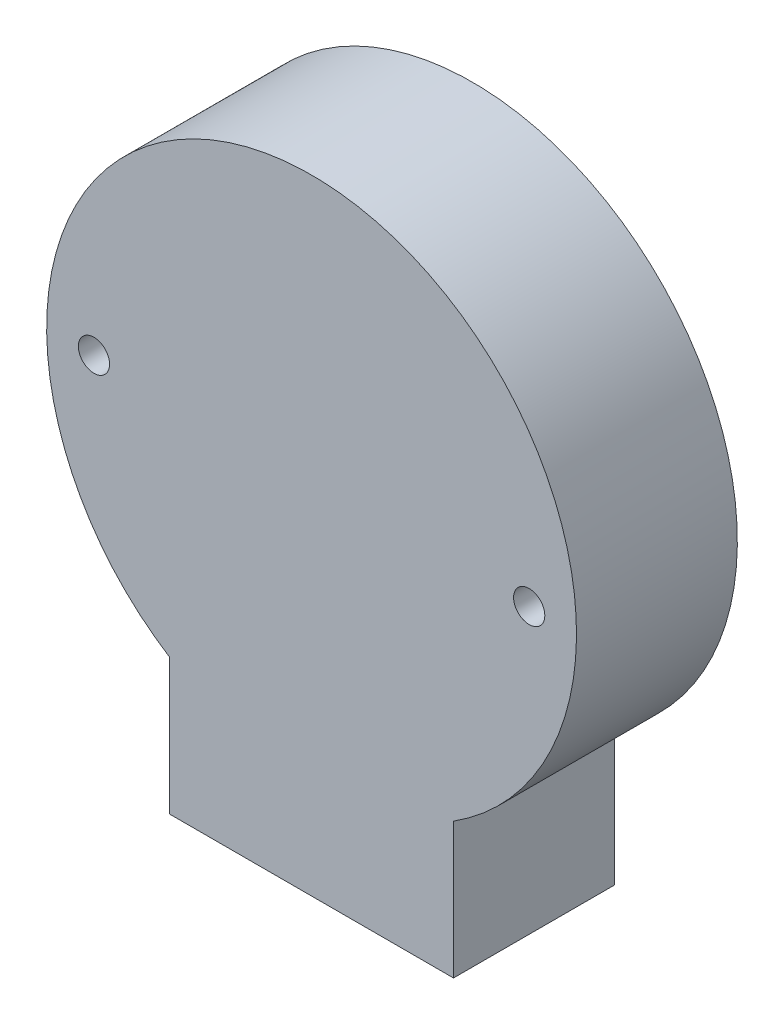
ISO-10303-21;
HEADER;
FILE_DESCRIPTION(('STEP AP214'),'2;1');
FILE_NAME('part.step','',(''),(''),'','','');
FILE_SCHEMA(('AUTOMOTIVE_DESIGN { 1 0 10303 214 1 1 1 1 }'));
ENDSEC;
DATA;
#1=APPLICATION_CONTEXT('core data for automotive mechanical design processes');
#2=APPLICATION_PROTOCOL_DEFINITION('international standard','automotive_design',2000,#1);
#3=PRODUCT_CONTEXT('',#1,'mechanical');
#4=PRODUCT('Part','Part','',(#3));
#5=PRODUCT_RELATED_PRODUCT_CATEGORY('part','',(#4));
#6=PRODUCT_DEFINITION_FORMATION('','',#4);
#7=PRODUCT_DEFINITION_CONTEXT('part definition',#1,'design');
#8=PRODUCT_DEFINITION('design','',#6,#7);
#9=PRODUCT_DEFINITION_SHAPE('','',#8);
#10=(LENGTH_UNIT() NAMED_UNIT(*) SI_UNIT(.MILLI.,.METRE.));
#11=(NAMED_UNIT(*) PLANE_ANGLE_UNIT() SI_UNIT($,.RADIAN.));
#12=(NAMED_UNIT(*) SI_UNIT($,.STERADIAN.) SOLID_ANGLE_UNIT());
#13=UNCERTAINTY_MEASURE_WITH_UNIT(LENGTH_MEASURE(1.E-05),#10,'distance_accuracy_value','');
#14=(GEOMETRIC_REPRESENTATION_CONTEXT(3) GLOBAL_UNCERTAINTY_ASSIGNED_CONTEXT((#13)) GLOBAL_UNIT_ASSIGNED_CONTEXT((#10,
#11,#12)) REPRESENTATION_CONTEXT('',''));
#15=CARTESIAN_POINT('',(0.,0.,0.));
#16=DIRECTION('',(0.,0.,1.));
#17=DIRECTION('',(1.,0.,0.));
#18=AXIS2_PLACEMENT_3D('',#15,#16,#17);
#19=CARTESIAN_POINT('',(0.,0.,17.));
#20=DIRECTION('',(0.,0.,-1.));
#21=DIRECTION('',(-1.,0.,0.));
#22=AXIS2_PLACEMENT_3D('',#19,#20,#21);
#23=CYLINDRICAL_SURFACE('',#22,28.);
#24=CARTESIAN_POINT('',(0.,0.,0.));
#25=DIRECTION('',(0.,0.,1.));
#26=DIRECTION('',(1.,0.,0.));
#27=AXIS2_PLACEMENT_3D('',#24,#25,#26);
#28=CIRCLE('',#27,28.);
#29=CARTESIAN_POINT('',(15.,-23.6431808350738,0.));
#30=VERTEX_POINT('',#29);
#31=CARTESIAN_POINT('',(-15.,-23.6431808350738,0.));
#32=VERTEX_POINT('',#31);
#33=EDGE_CURVE('E97',#30,#32,#28,.T.);
#34=ORIENTED_EDGE('',*,*,#33,.T.);
#35=DIRECTION('',(0.,0.,-1.));
#36=VECTOR('',#35,1.);
#37=CARTESIAN_POINT('',(-15.,-23.6431808350738,17.));
#38=LINE('',#37,#36);
#39=CARTESIAN_POINT('',(-15.,-23.6431808350738,17.));
#40=VERTEX_POINT('',#39);
#41=EDGE_CURVE('E11',#40,#32,#38,.T.);
#42=ORIENTED_EDGE('',*,*,#41,.F.);
#43=CARTESIAN_POINT('',(0.,0.,17.));
#44=DIRECTION('',(0.,0.,1.));
#45=DIRECTION('',(1.,0.,0.));
#46=AXIS2_PLACEMENT_3D('',#43,#44,#45);
#47=CIRCLE('',#46,28.);
#48=CARTESIAN_POINT('',(15.,-23.6431808350738,17.));
#49=VERTEX_POINT('',#48);
#50=EDGE_CURVE('E84',#49,#40,#47,.T.);
#51=ORIENTED_EDGE('',*,*,#50,.F.);
#52=DIRECTION('',(0.,0.,-1.));
#53=VECTOR('',#52,1.);
#54=CARTESIAN_POINT('',(15.,-23.6431808350738,17.));
#55=LINE('',#54,#53);
#56=EDGE_CURVE('E93',#49,#30,#55,.T.);
#57=ORIENTED_EDGE('',*,*,#56,.T.);
#58=EDGE_LOOP('',(#34,#42,#51,#57));
#59=FACE_BOUND('',#58,.T.);
#60=ADVANCED_FACE('F31',(#59),#23,.T.);
#61=CARTESIAN_POINT('',(-15.,-23.6431808350738,17.));
#62=DIRECTION('',(1.,0.,0.));
#63=DIRECTION('',(0.,0.,-1.));
#64=AXIS2_PLACEMENT_3D('',#61,#62,#63);
#65=PLANE('',#64);
#66=DIRECTION('',(0.,-1.,0.));
#67=VECTOR('',#66,1.);
#68=CARTESIAN_POINT('',(-15.,-23.6431808350738,0.));
#69=LINE('',#68,#67);
#70=CARTESIAN_POINT('',(-15.,-38.,0.));
#71=VERTEX_POINT('',#70);
#72=EDGE_CURVE('E88',#32,#71,#69,.T.);
#73=ORIENTED_EDGE('',*,*,#72,.T.);
#74=DIRECTION('',(0.,0.,-1.));
#75=VECTOR('',#74,1.);
#76=CARTESIAN_POINT('',(-15.,-38.,17.));
#77=LINE('',#76,#75);
#78=CARTESIAN_POINT('',(-15.,-38.,17.));
#79=VERTEX_POINT('',#78);
#80=EDGE_CURVE('E40',#79,#71,#77,.T.);
#81=ORIENTED_EDGE('',*,*,#80,.F.);
#82=DIRECTION('',(0.,-1.,0.));
#83=VECTOR('',#82,1.);
#84=CARTESIAN_POINT('',(-15.,-23.6431808350738,17.));
#85=LINE('',#84,#83);
#86=EDGE_CURVE('E79',#40,#79,#85,.T.);
#87=ORIENTED_EDGE('',*,*,#86,.F.);
#88=ORIENTED_EDGE('',*,*,#41,.T.);
#89=EDGE_LOOP('',(#73,#81,#87,#88));
#90=FACE_BOUND('',#89,.T.);
#91=ADVANCED_FACE('F87',(#90),#65,.F.);
#92=CARTESIAN_POINT('',(-15.,-38.,17.));
#93=DIRECTION('',(0.,1.,0.));
#94=DIRECTION('',(0.,0.,1.));
#95=AXIS2_PLACEMENT_3D('',#92,#93,#94);
#96=PLANE('',#95);
#97=DIRECTION('',(1.,0.,0.));
#98=VECTOR('',#97,1.);
#99=CARTESIAN_POINT('',(-15.,-38.,0.));
#100=LINE('',#99,#98);
#101=CARTESIAN_POINT('',(15.,-38.,0.));
#102=VERTEX_POINT('',#101);
#103=EDGE_CURVE('E66',#71,#102,#100,.T.);
#104=ORIENTED_EDGE('',*,*,#103,.T.);
#105=DIRECTION('',(0.,0.,-1.));
#106=VECTOR('',#105,1.);
#107=CARTESIAN_POINT('',(15.,-38.,17.));
#108=LINE('',#107,#106);
#109=CARTESIAN_POINT('',(15.,-38.,17.));
#110=VERTEX_POINT('',#109);
#111=EDGE_CURVE('E89',#110,#102,#108,.T.);
#112=ORIENTED_EDGE('',*,*,#111,.F.);
#113=DIRECTION('',(1.,0.,0.));
#114=VECTOR('',#113,1.);
#115=CARTESIAN_POINT('',(-15.,-38.,17.));
#116=LINE('',#115,#114);
#117=EDGE_CURVE('E82',#79,#110,#116,.T.);
#118=ORIENTED_EDGE('',*,*,#117,.F.);
#119=ORIENTED_EDGE('',*,*,#80,.T.);
#120=EDGE_LOOP('',(#104,#112,#118,#119));
#121=FACE_BOUND('',#120,.T.);
#122=ADVANCED_FACE('F91',(#121),#96,.F.);
#123=CARTESIAN_POINT('',(15.,-23.6431808350738,17.));
#124=DIRECTION('',(-1.,0.,0.));
#125=DIRECTION('',(0.,0.,1.));
#126=AXIS2_PLACEMENT_3D('',#123,#124,#125);
#127=PLANE('',#126);
#128=DIRECTION('',(0.,1.,0.));
#129=VECTOR('',#128,1.);
#130=CARTESIAN_POINT('',(15.,-23.6431808350738,0.));
#131=LINE('',#130,#129);
#132=EDGE_CURVE('E72',#102,#30,#131,.T.);
#133=ORIENTED_EDGE('',*,*,#132,.T.);
#134=ORIENTED_EDGE('',*,*,#56,.F.);
#135=DIRECTION('',(0.,1.,0.));
#136=VECTOR('',#135,1.);
#137=CARTESIAN_POINT('',(15.,-23.6431808350738,17.));
#138=LINE('',#137,#136);
#139=EDGE_CURVE('E49',#110,#49,#138,.T.);
#140=ORIENTED_EDGE('',*,*,#139,.F.);
#141=ORIENTED_EDGE('',*,*,#111,.T.);
#142=EDGE_LOOP('',(#133,#134,#140,#141));
#143=FACE_BOUND('',#142,.T.);
#144=ADVANCED_FACE('F125',(#143),#127,.F.);
#145=CARTESIAN_POINT('',(0.,0.,17.));
#146=DIRECTION('',(0.,0.,1.));
#147=DIRECTION('',(1.,0.,0.));
#148=AXIS2_PLACEMENT_3D('',#145,#146,#147);
#149=PLANE('',#148);
#150=CARTESIAN_POINT('',(-23.,0.,17.));
#151=DIRECTION('',(0.,0.,1.));
#152=DIRECTION('',(1.,0.,0.));
#153=AXIS2_PLACEMENT_3D('',#150,#151,#152);
#154=CIRCLE('',#153,1.65);
#155=CARTESIAN_POINT('',(-21.35,0.,17.));
#156=VERTEX_POINT('',#155);
#157=EDGE_CURVE('E114',#156,#156,#154,.T.);
#158=ORIENTED_EDGE('',*,*,#157,.F.);
#159=EDGE_LOOP('',(#158));
#160=FACE_BOUND('',#159,.T.);
#161=CARTESIAN_POINT('',(23.,0.,17.));
#162=DIRECTION('',(0.,0.,1.));
#163=DIRECTION('',(1.,0.,0.));
#164=AXIS2_PLACEMENT_3D('',#161,#162,#163);
#165=CIRCLE('',#164,1.65);
#166=CARTESIAN_POINT('',(24.65,0.,17.));
#167=VERTEX_POINT('',#166);
#168=EDGE_CURVE('E106',#167,#167,#165,.T.);
#169=ORIENTED_EDGE('',*,*,#168,.F.);
#170=EDGE_LOOP('',(#169));
#171=FACE_BOUND('',#170,.T.);
#172=ORIENTED_EDGE('',*,*,#50,.T.);
#173=ORIENTED_EDGE('',*,*,#86,.T.);
#174=ORIENTED_EDGE('',*,*,#117,.T.);
#175=ORIENTED_EDGE('',*,*,#139,.T.);
#176=EDGE_LOOP('',(#172,#173,#174,#175));
#177=FACE_BOUND('',#176,.T.);
#178=ADVANCED_FACE('F80',(#160,#171,#177),#149,.T.);
#179=CARTESIAN_POINT('',(0.,0.,0.));
#180=DIRECTION('',(0.,0.,1.));
#181=DIRECTION('',(1.,0.,0.));
#182=AXIS2_PLACEMENT_3D('',#179,#180,#181);
#183=PLANE('',#182);
#184=CARTESIAN_POINT('',(-23.,0.,0.));
#185=DIRECTION('',(0.,0.,1.));
#186=DIRECTION('',(1.,0.,0.));
#187=AXIS2_PLACEMENT_3D('',#184,#185,#186);
#188=CIRCLE('',#187,1.65);
#189=CARTESIAN_POINT('',(-21.35,0.,0.));
#190=VERTEX_POINT('',#189);
#191=EDGE_CURVE('E34',#190,#190,#188,.T.);
#192=ORIENTED_EDGE('',*,*,#191,.T.);
#193=EDGE_LOOP('',(#192));
#194=FACE_BOUND('',#193,.T.);
#195=CARTESIAN_POINT('',(23.,0.,0.));
#196=DIRECTION('',(0.,0.,1.));
#197=DIRECTION('',(1.,0.,0.));
#198=AXIS2_PLACEMENT_3D('',#195,#196,#197);
#199=CIRCLE('',#198,1.65);
#200=CARTESIAN_POINT('',(24.65,0.,0.));
#201=VERTEX_POINT('',#200);
#202=EDGE_CURVE('E100',#201,#201,#199,.T.);
#203=ORIENTED_EDGE('',*,*,#202,.T.);
#204=EDGE_LOOP('',(#203));
#205=FACE_BOUND('',#204,.T.);
#206=ORIENTED_EDGE('',*,*,#33,.F.);
#207=ORIENTED_EDGE('',*,*,#132,.F.);
#208=ORIENTED_EDGE('',*,*,#103,.F.);
#209=ORIENTED_EDGE('',*,*,#72,.F.);
#210=EDGE_LOOP('',(#206,#207,#208,#209));
#211=FACE_BOUND('',#210,.T.);
#212=ADVANCED_FACE('F124',(#194,#205,#211),#183,.F.);
#213=CARTESIAN_POINT('',(23.,0.,17.));
#214=DIRECTION('',(0.,0.,1.));
#215=DIRECTION('',(1.,0.,0.));
#216=AXIS2_PLACEMENT_3D('',#213,#214,#215);
#217=CYLINDRICAL_SURFACE('',#216,1.65);
#218=ORIENTED_EDGE('',*,*,#168,.T.);
#219=EDGE_LOOP('',(#218));
#220=FACE_BOUND('',#219,.T.);
#221=ORIENTED_EDGE('',*,*,#202,.F.);
#222=EDGE_LOOP('',(#221));
#223=FACE_BOUND('',#222,.T.);
#224=ADVANCED_FACE('F131',(#220,#223),#217,.F.);
#225=CARTESIAN_POINT('',(-23.,0.,17.));
#226=DIRECTION('',(0.,0.,1.));
#227=DIRECTION('',(1.,0.,0.));
#228=AXIS2_PLACEMENT_3D('',#225,#226,#227);
#229=CYLINDRICAL_SURFACE('',#228,1.65);
#230=ORIENTED_EDGE('',*,*,#157,.T.);
#231=EDGE_LOOP('',(#230));
#232=FACE_BOUND('',#231,.T.);
#233=ORIENTED_EDGE('',*,*,#191,.F.);
#234=EDGE_LOOP('',(#233));
#235=FACE_BOUND('',#234,.T.);
#236=ADVANCED_FACE('F119',(#232,#235),#229,.F.);
#237=CLOSED_SHELL('',(#60,#91,#122,#144,#178,#212,#224,#236));
#238=MANIFOLD_SOLID_BREP('B2',#237);
#239=ADVANCED_BREP_SHAPE_REPRESENTATION('',(#18,#238),#14);
#240=SHAPE_DEFINITION_REPRESENTATION(#9,#239);
ENDSEC;
END-ISO-10303-21;
